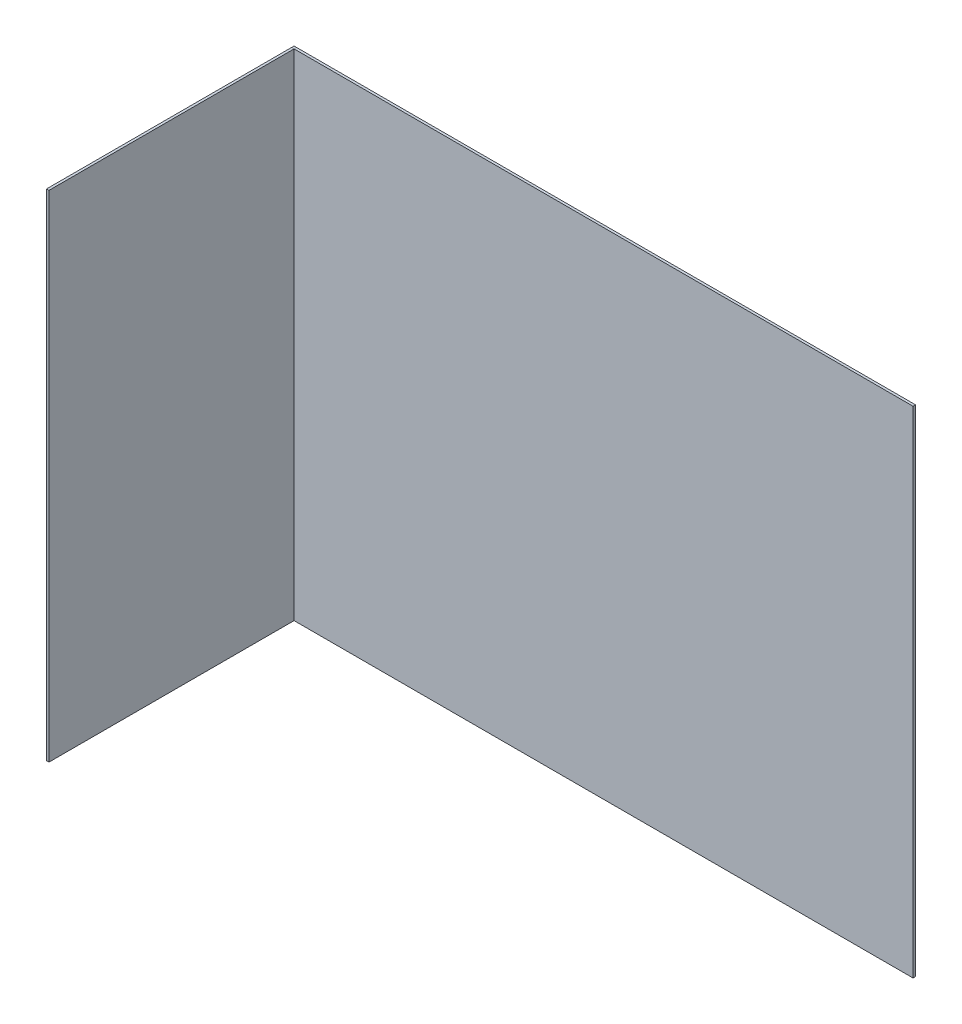
ISO-10303-21;
HEADER;
FILE_DESCRIPTION(('STEP AP214'),'2;1');
FILE_NAME('part.step','',(''),(''),'','','');
FILE_SCHEMA(('AUTOMOTIVE_DESIGN { 1 0 10303 214 1 1 1 1 }'));
ENDSEC;
DATA;
#1=APPLICATION_CONTEXT('core data for automotive mechanical design processes');
#2=APPLICATION_PROTOCOL_DEFINITION('international standard','automotive_design',2000,#1);
#3=PRODUCT_CONTEXT('',#1,'mechanical');
#4=PRODUCT('Part','Part','',(#3));
#5=PRODUCT_RELATED_PRODUCT_CATEGORY('part','',(#4));
#6=PRODUCT_DEFINITION_FORMATION('','',#4);
#7=PRODUCT_DEFINITION_CONTEXT('part definition',#1,'design');
#8=PRODUCT_DEFINITION('design','',#6,#7);
#9=PRODUCT_DEFINITION_SHAPE('','',#8);
#10=(LENGTH_UNIT() NAMED_UNIT(*) SI_UNIT(.MILLI.,.METRE.));
#11=(NAMED_UNIT(*) PLANE_ANGLE_UNIT() SI_UNIT($,.RADIAN.));
#12=(NAMED_UNIT(*) SI_UNIT($,.STERADIAN.) SOLID_ANGLE_UNIT());
#13=UNCERTAINTY_MEASURE_WITH_UNIT(LENGTH_MEASURE(1.E-05),#10,'distance_accuracy_value','');
#14=(GEOMETRIC_REPRESENTATION_CONTEXT(3) GLOBAL_UNCERTAINTY_ASSIGNED_CONTEXT((#13)) GLOBAL_UNIT_ASSIGNED_CONTEXT((#10,
#11,#12)) REPRESENTATION_CONTEXT('',''));
#15=CARTESIAN_POINT('',(0.,0.,0.));
#16=DIRECTION('',(0.,0.,1.));
#17=DIRECTION('',(1.,0.,0.));
#18=AXIS2_PLACEMENT_3D('',#15,#16,#17);
#19=CARTESIAN_POINT('',(-0.001,0.,0.));
#20=DIRECTION('',(1.,0.,0.));
#21=DIRECTION('',(0.,0.,1.));
#22=AXIS2_PLACEMENT_3D('',#19,#20,#21);
#23=PLANE('',#22);
#24=DIRECTION('',(0.,0.,1.));
#25=VECTOR('',#24,1.);
#26=CARTESIAN_POINT('',(-0.001,0.,0.));
#27=LINE('',#26,#25);
#28=CARTESIAN_POINT('',(-0.001,0.,0.001));
#29=VERTEX_POINT('',#28);
#30=CARTESIAN_POINT('',(-0.001,0.,0.1));
#31=VERTEX_POINT('',#30);
#32=EDGE_CURVE('E190',#29,#31,#27,.T.);
#33=ORIENTED_EDGE('',*,*,#32,.T.);
#34=DIRECTION('',(0.,1.,0.));
#35=VECTOR('',#34,1.);
#36=CARTESIAN_POINT('',(-0.001,0.,0.1));
#37=LINE('',#36,#35);
#38=CARTESIAN_POINT('',(-0.001,0.2,0.1));
#39=VERTEX_POINT('',#38);
#40=EDGE_CURVE('E11',#31,#39,#37,.T.);
#41=ORIENTED_EDGE('',*,*,#40,.T.);
#42=DIRECTION('',(0.,0.,-1.));
#43=VECTOR('',#42,1.);
#44=CARTESIAN_POINT('',(-0.001,0.2,0.1));
#45=LINE('',#44,#43);
#46=CARTESIAN_POINT('',(-0.001,0.2,0.001));
#47=VERTEX_POINT('',#46);
#48=EDGE_CURVE('E152',#39,#47,#45,.T.);
#49=ORIENTED_EDGE('',*,*,#48,.T.);
#50=DIRECTION('',(0.,-1.,0.));
#51=VECTOR('',#50,1.);
#52=CARTESIAN_POINT('',(-0.001,0.2,0.001));
#53=LINE('',#52,#51);
#54=EDGE_CURVE('E187',#47,#29,#53,.T.);
#55=ORIENTED_EDGE('',*,*,#54,.T.);
#56=EDGE_LOOP('',(#33,#41,#49,#55));
#57=FACE_BOUND('',#56,.T.);
#58=ADVANCED_FACE('F16',(#57),#23,.F.);
#59=CARTESIAN_POINT('',(0.,0.,0.1));
#60=DIRECTION('',(0.,0.,-1.));
#61=DIRECTION('',(0.,-1.,0.));
#62=AXIS2_PLACEMENT_3D('',#59,#60,#61);
#63=PLANE('',#62);
#64=DIRECTION('',(-1.,0.,0.));
#65=VECTOR('',#64,1.);
#66=CARTESIAN_POINT('',(0.,0.,0.1));
#67=LINE('',#66,#65);
#68=CARTESIAN_POINT('',(0.,0.,0.1));
#69=VERTEX_POINT('',#68);
#70=EDGE_CURVE('E195',#69,#31,#67,.T.);
#71=ORIENTED_EDGE('',*,*,#70,.F.);
#72=DIRECTION('',(0.,1.,0.));
#73=VECTOR('',#72,1.);
#74=CARTESIAN_POINT('',(0.,0.,0.1));
#75=LINE('',#74,#73);
#76=CARTESIAN_POINT('',(0.,0.2,0.1));
#77=VERTEX_POINT('',#76);
#78=EDGE_CURVE('E102',#69,#77,#75,.T.);
#79=ORIENTED_EDGE('',*,*,#78,.T.);
#80=DIRECTION('',(-1.,0.,0.));
#81=VECTOR('',#80,1.);
#82=CARTESIAN_POINT('',(0.,0.2,0.1));
#83=LINE('',#82,#81);
#84=EDGE_CURVE('E27',#77,#39,#83,.T.);
#85=ORIENTED_EDGE('',*,*,#84,.T.);
#86=ORIENTED_EDGE('',*,*,#40,.F.);
#87=EDGE_LOOP('',(#71,#79,#85,#86));
#88=FACE_BOUND('',#87,.T.);
#89=ADVANCED_FACE('F422',(#88),#63,.F.);
#90=CARTESIAN_POINT('',(0.,0.2,0.1));
#91=DIRECTION('',(0.,-1.,0.));
#92=DIRECTION('',(0.,0.,-1.));
#93=AXIS2_PLACEMENT_3D('',#90,#91,#92);
#94=PLANE('',#93);
#95=DIRECTION('',(0.,0.,-1.));
#96=VECTOR('',#95,1.);
#97=CARTESIAN_POINT('',(0.,0.2,0.1));
#98=LINE('',#97,#96);
#99=CARTESIAN_POINT('',(0.,0.2,0.001));
#100=VERTEX_POINT('',#99);
#101=EDGE_CURVE('E91',#77,#100,#98,.T.);
#102=ORIENTED_EDGE('',*,*,#101,.T.);
#103=DIRECTION('',(-1.,0.,0.));
#104=VECTOR('',#103,1.);
#105=CARTESIAN_POINT('',(0.25,0.2,0.001));
#106=LINE('',#105,#104);
#107=EDGE_CURVE('E95',#100,#47,#106,.T.);
#108=ORIENTED_EDGE('',*,*,#107,.T.);
#109=ORIENTED_EDGE('',*,*,#48,.F.);
#110=ORIENTED_EDGE('',*,*,#84,.F.);
#111=EDGE_LOOP('',(#102,#108,#109,#110));
#112=FACE_BOUND('',#111,.T.);
#113=ADVANCED_FACE('F93',(#112),#94,.F.);
#114=CARTESIAN_POINT('',(-0.001,0.2,0.));
#115=DIRECTION('',(1.,0.,0.));
#116=DIRECTION('',(0.,1.,0.));
#117=AXIS2_PLACEMENT_3D('',#114,#115,#116);
#118=PLANE('',#117);
#119=DIRECTION('',(0.,0.,1.));
#120=VECTOR('',#119,1.);
#121=CARTESIAN_POINT('',(-0.001,0.2,0.));
#122=LINE('',#121,#120);
#123=CARTESIAN_POINT('',(-0.001,0.2,0.));
#124=VERTEX_POINT('',#123);
#125=EDGE_CURVE('E113',#124,#47,#122,.T.);
#126=ORIENTED_EDGE('',*,*,#125,.F.);
#127=DIRECTION('',(0.,-1.,0.));
#128=VECTOR('',#127,1.);
#129=CARTESIAN_POINT('',(-0.001,0.2,0.));
#130=LINE('',#129,#128);
#131=CARTESIAN_POINT('',(-0.001,0.,0.));
#132=VERTEX_POINT('',#131);
#133=EDGE_CURVE('E115',#124,#132,#130,.T.);
#134=ORIENTED_EDGE('',*,*,#133,.T.);
#135=DIRECTION('',(0.,0.,1.));
#136=VECTOR('',#135,1.);
#137=CARTESIAN_POINT('',(-0.001,0.,0.));
#138=LINE('',#137,#136);
#139=EDGE_CURVE('E161',#132,#29,#138,.T.);
#140=ORIENTED_EDGE('',*,*,#139,.T.);
#141=ORIENTED_EDGE('',*,*,#54,.F.);
#142=EDGE_LOOP('',(#126,#134,#140,#141));
#143=FACE_BOUND('',#142,.T.);
#144=ADVANCED_FACE('F237',(#143),#118,.F.);
#145=CARTESIAN_POINT('',(0.,0.,0.));
#146=DIRECTION('',(0.,1.,0.));
#147=DIRECTION('',(1.,0.,0.));
#148=AXIS2_PLACEMENT_3D('',#145,#146,#147);
#149=PLANE('',#148);
#150=DIRECTION('',(0.,0.,1.));
#151=VECTOR('',#150,1.);
#152=CARTESIAN_POINT('',(0.,0.,0.));
#153=LINE('',#152,#151);
#154=CARTESIAN_POINT('',(0.,0.,0.001));
#155=VERTEX_POINT('',#154);
#156=EDGE_CURVE('E103',#155,#69,#153,.T.);
#157=ORIENTED_EDGE('',*,*,#156,.T.);
#158=ORIENTED_EDGE('',*,*,#70,.T.);
#159=ORIENTED_EDGE('',*,*,#32,.F.);
#160=DIRECTION('',(1.,0.,0.));
#161=VECTOR('',#160,1.);
#162=CARTESIAN_POINT('',(-0.001,0.,0.001));
#163=LINE('',#162,#161);
#164=EDGE_CURVE('E126',#29,#155,#163,.T.);
#165=ORIENTED_EDGE('',*,*,#164,.T.);
#166=EDGE_LOOP('',(#157,#158,#159,#165));
#167=FACE_BOUND('',#166,.T.);
#168=ADVANCED_FACE('F18',(#167),#149,.F.);
#169=CARTESIAN_POINT('',(0.,0.,0.));
#170=DIRECTION('',(1.,0.,0.));
#171=DIRECTION('',(0.,0.,1.));
#172=AXIS2_PLACEMENT_3D('',#169,#170,#171);
#173=PLANE('',#172);
#174=ORIENTED_EDGE('',*,*,#156,.F.);
#175=DIRECTION('',(0.,-1.,0.));
#176=VECTOR('',#175,1.);
#177=CARTESIAN_POINT('',(0.,0.,0.001));
#178=LINE('',#177,#176);
#179=EDGE_CURVE('E118',#100,#155,#178,.T.);
#180=ORIENTED_EDGE('',*,*,#179,.F.);
#181=ORIENTED_EDGE('',*,*,#101,.F.);
#182=ORIENTED_EDGE('',*,*,#78,.F.);
#183=EDGE_LOOP('',(#174,#180,#181,#182));
#184=FACE_BOUND('',#183,.T.);
#185=ADVANCED_FACE('F120',(#184),#173,.T.);
#186=CARTESIAN_POINT('',(-0.001,0.,0.));
#187=DIRECTION('',(0.,0.,-1.));
#188=DIRECTION('',(0.,-1.,0.));
#189=AXIS2_PLACEMENT_3D('',#186,#187,#188);
#190=PLANE('',#189);
#191=DIRECTION('',(0.,-1.,0.));
#192=VECTOR('',#191,1.);
#193=CARTESIAN_POINT('',(0.,0.2,0.));
#194=LINE('',#193,#192);
#195=CARTESIAN_POINT('',(0.,0.2,0.));
#196=VERTEX_POINT('',#195);
#197=CARTESIAN_POINT('',(0.,0.,0.));
#198=VERTEX_POINT('',#197);
#199=EDGE_CURVE('E127',#196,#198,#194,.T.);
#200=ORIENTED_EDGE('',*,*,#199,.T.);
#201=DIRECTION('',(-1.,0.,0.));
#202=VECTOR('',#201,1.);
#203=CARTESIAN_POINT('',(0.,0.,0.));
#204=LINE('',#203,#202);
#205=EDGE_CURVE('E20',#198,#132,#204,.T.);
#206=ORIENTED_EDGE('',*,*,#205,.T.);
#207=ORIENTED_EDGE('',*,*,#133,.F.);
#208=DIRECTION('',(-1.,0.,0.));
#209=VECTOR('',#208,1.);
#210=CARTESIAN_POINT('',(0.,0.2,0.));
#211=LINE('',#210,#209);
#212=EDGE_CURVE('E153',#196,#124,#211,.T.);
#213=ORIENTED_EDGE('',*,*,#212,.F.);
#214=EDGE_LOOP('',(#200,#206,#207,#213));
#215=FACE_BOUND('',#214,.T.);
#216=ADVANCED_FACE('F230',(#215),#190,.T.);
#217=CARTESIAN_POINT('',(0.,0.2,0.1));
#218=DIRECTION('',(0.,-1.,0.));
#219=DIRECTION('',(0.,0.,-1.));
#220=AXIS2_PLACEMENT_3D('',#217,#218,#219);
#221=PLANE('',#220);
#222=DIRECTION('',(0.,0.,-1.));
#223=VECTOR('',#222,1.);
#224=CARTESIAN_POINT('',(0.,0.2,0.1));
#225=LINE('',#224,#223);
#226=EDGE_CURVE('E110',#100,#196,#225,.T.);
#227=ORIENTED_EDGE('',*,*,#226,.T.);
#228=ORIENTED_EDGE('',*,*,#212,.T.);
#229=ORIENTED_EDGE('',*,*,#125,.T.);
#230=ORIENTED_EDGE('',*,*,#107,.F.);
#231=EDGE_LOOP('',(#227,#228,#229,#230));
#232=FACE_BOUND('',#231,.T.);
#233=ADVANCED_FACE('F107',(#232),#221,.F.);
#234=CARTESIAN_POINT('',(0.,0.,0.));
#235=DIRECTION('',(0.,1.,0.));
#236=DIRECTION('',(1.,0.,0.));
#237=AXIS2_PLACEMENT_3D('',#234,#235,#236);
#238=PLANE('',#237);
#239=DIRECTION('',(0.,0.,1.));
#240=VECTOR('',#239,1.);
#241=CARTESIAN_POINT('',(0.,0.,0.));
#242=LINE('',#241,#240);
#243=EDGE_CURVE('E148',#198,#155,#242,.T.);
#244=ORIENTED_EDGE('',*,*,#243,.T.);
#245=ORIENTED_EDGE('',*,*,#164,.F.);
#246=ORIENTED_EDGE('',*,*,#139,.F.);
#247=ORIENTED_EDGE('',*,*,#205,.F.);
#248=EDGE_LOOP('',(#244,#245,#246,#247));
#249=FACE_BOUND('',#248,.T.);
#250=ADVANCED_FACE('F212',(#249),#238,.F.);
#251=CARTESIAN_POINT('',(-0.001,0.,0.001));
#252=DIRECTION('',(0.,0.,-1.));
#253=DIRECTION('',(0.,-1.,0.));
#254=AXIS2_PLACEMENT_3D('',#251,#252,#253);
#255=PLANE('',#254);
#256=DIRECTION('',(1.,0.,0.));
#257=VECTOR('',#256,1.);
#258=CARTESIAN_POINT('',(-0.001,0.,0.001));
#259=LINE('',#258,#257);
#260=CARTESIAN_POINT('',(0.25,0.,0.001));
#261=VERTEX_POINT('',#260);
#262=EDGE_CURVE('E173',#155,#261,#259,.T.);
#263=ORIENTED_EDGE('',*,*,#262,.T.);
#264=DIRECTION('',(0.,1.,0.));
#265=VECTOR('',#264,1.);
#266=CARTESIAN_POINT('',(0.25,0.,0.001));
#267=LINE('',#266,#265);
#268=CARTESIAN_POINT('',(0.25,0.2,0.001));
#269=VERTEX_POINT('',#268);
#270=EDGE_CURVE('E133',#261,#269,#267,.T.);
#271=ORIENTED_EDGE('',*,*,#270,.T.);
#272=DIRECTION('',(-1.,0.,0.));
#273=VECTOR('',#272,1.);
#274=CARTESIAN_POINT('',(0.25,0.2,0.001));
#275=LINE('',#274,#273);
#276=EDGE_CURVE('E130',#269,#100,#275,.T.);
#277=ORIENTED_EDGE('',*,*,#276,.T.);
#278=ORIENTED_EDGE('',*,*,#179,.T.);
#279=EDGE_LOOP('',(#263,#271,#277,#278));
#280=FACE_BOUND('',#279,.T.);
#281=ADVANCED_FACE('F131',(#280),#255,.F.);
#282=CARTESIAN_POINT('',(-0.001,0.,0.));
#283=DIRECTION('',(0.,0.,-1.));
#284=DIRECTION('',(0.,-1.,0.));
#285=AXIS2_PLACEMENT_3D('',#282,#283,#284);
#286=PLANE('',#285);
#287=DIRECTION('',(1.,0.,0.));
#288=VECTOR('',#287,1.);
#289=CARTESIAN_POINT('',(-0.001,0.,0.));
#290=LINE('',#289,#288);
#291=CARTESIAN_POINT('',(0.25,0.,0.));
#292=VERTEX_POINT('',#291);
#293=EDGE_CURVE('E170',#198,#292,#290,.T.);
#294=ORIENTED_EDGE('',*,*,#293,.F.);
#295=ORIENTED_EDGE('',*,*,#199,.F.);
#296=DIRECTION('',(-1.,0.,0.));
#297=VECTOR('',#296,1.);
#298=CARTESIAN_POINT('',(0.25,0.2,0.));
#299=LINE('',#298,#297);
#300=CARTESIAN_POINT('',(0.25,0.2,0.));
#301=VERTEX_POINT('',#300);
#302=EDGE_CURVE('E141',#301,#196,#299,.T.);
#303=ORIENTED_EDGE('',*,*,#302,.F.);
#304=DIRECTION('',(0.,1.,0.));
#305=VECTOR('',#304,1.);
#306=CARTESIAN_POINT('',(0.25,0.,0.));
#307=LINE('',#306,#305);
#308=EDGE_CURVE('E169',#292,#301,#307,.T.);
#309=ORIENTED_EDGE('',*,*,#308,.F.);
#310=EDGE_LOOP('',(#294,#295,#303,#309));
#311=FACE_BOUND('',#310,.T.);
#312=ADVANCED_FACE('F228',(#311),#286,.T.);
#313=CARTESIAN_POINT('',(0.25,0.2,0.));
#314=DIRECTION('',(0.,-1.,0.));
#315=DIRECTION('',(0.,0.,-1.));
#316=AXIS2_PLACEMENT_3D('',#313,#314,#315);
#317=PLANE('',#316);
#318=ORIENTED_EDGE('',*,*,#302,.T.);
#319=ORIENTED_EDGE('',*,*,#226,.F.);
#320=ORIENTED_EDGE('',*,*,#276,.F.);
#321=DIRECTION('',(0.,0.,1.));
#322=VECTOR('',#321,1.);
#323=CARTESIAN_POINT('',(0.25,0.2,0.));
#324=LINE('',#323,#322);
#325=EDGE_CURVE('E174',#301,#269,#324,.T.);
#326=ORIENTED_EDGE('',*,*,#325,.F.);
#327=EDGE_LOOP('',(#318,#319,#320,#326));
#328=FACE_BOUND('',#327,.T.);
#329=ADVANCED_FACE('F139',(#328),#317,.F.);
#330=CARTESIAN_POINT('',(-0.001,0.,0.));
#331=DIRECTION('',(0.,1.,0.));
#332=DIRECTION('',(1.,0.,0.));
#333=AXIS2_PLACEMENT_3D('',#330,#331,#332);
#334=PLANE('',#333);
#335=ORIENTED_EDGE('',*,*,#293,.T.);
#336=DIRECTION('',(0.,0.,1.));
#337=VECTOR('',#336,1.);
#338=CARTESIAN_POINT('',(0.25,0.,0.));
#339=LINE('',#338,#337);
#340=EDGE_CURVE('E165',#292,#261,#339,.T.);
#341=ORIENTED_EDGE('',*,*,#340,.T.);
#342=ORIENTED_EDGE('',*,*,#262,.F.);
#343=ORIENTED_EDGE('',*,*,#243,.F.);
#344=EDGE_LOOP('',(#335,#341,#342,#343));
#345=FACE_BOUND('',#344,.T.);
#346=ADVANCED_FACE('F219',(#345),#334,.F.);
#347=CARTESIAN_POINT('',(0.25,0.,0.));
#348=DIRECTION('',(-1.,0.,0.));
#349=DIRECTION('',(0.,0.,1.));
#350=AXIS2_PLACEMENT_3D('',#347,#348,#349);
#351=PLANE('',#350);
#352=ORIENTED_EDGE('',*,*,#340,.F.);
#353=ORIENTED_EDGE('',*,*,#308,.T.);
#354=ORIENTED_EDGE('',*,*,#325,.T.);
#355=ORIENTED_EDGE('',*,*,#270,.F.);
#356=EDGE_LOOP('',(#352,#353,#354,#355));
#357=FACE_BOUND('',#356,.T.);
#358=ADVANCED_FACE('F222',(#357),#351,.F.);
#359=CLOSED_SHELL('',(#58,#89,#113,#144,#168,#185,#216,#233,#250,#281,#312,#329,#346,#358));
#360=MANIFOLD_SOLID_BREP('B1',#359);
#361=ADVANCED_BREP_SHAPE_REPRESENTATION('',(#18,#360),#14);
#362=SHAPE_DEFINITION_REPRESENTATION(#9,#361);
ENDSEC;
END-ISO-10303-21;
